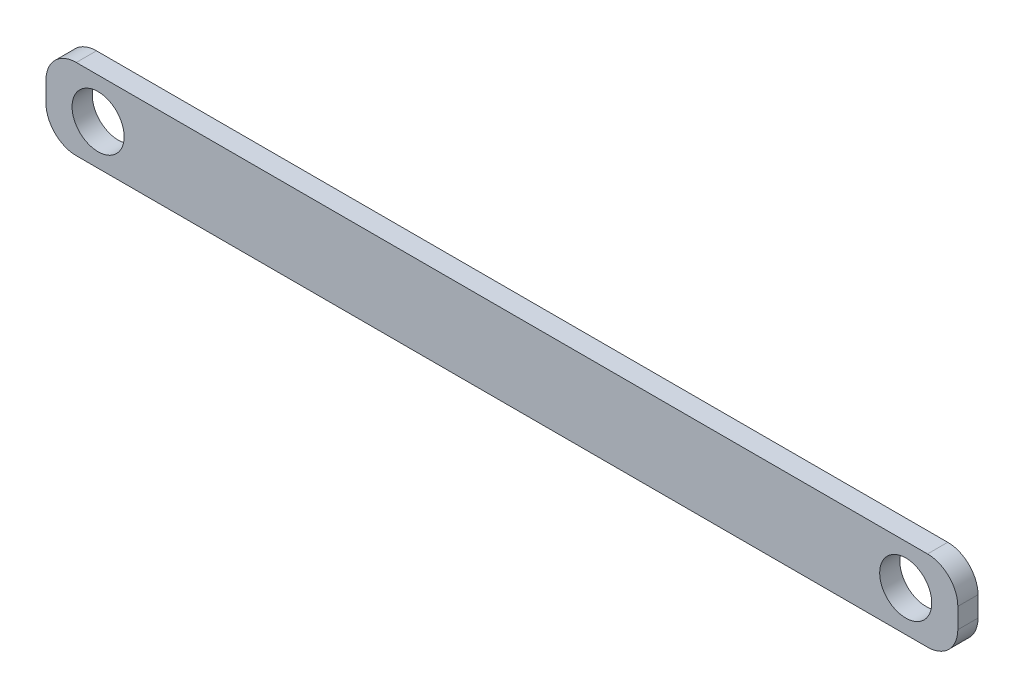
ISO-10303-21;
HEADER;
FILE_DESCRIPTION(('STEP AP214'),'2;1');
FILE_NAME('part.step','',(''),(''),'','','');
FILE_SCHEMA(('AUTOMOTIVE_DESIGN { 1 0 10303 214 1 1 1 1 }'));
ENDSEC;
DATA;
#1=APPLICATION_CONTEXT('core data for automotive mechanical design processes');
#2=APPLICATION_PROTOCOL_DEFINITION('international standard','automotive_design',2000,#1);
#3=PRODUCT_CONTEXT('',#1,'mechanical');
#4=PRODUCT('Part','Part','',(#3));
#5=PRODUCT_RELATED_PRODUCT_CATEGORY('part','',(#4));
#6=PRODUCT_DEFINITION_FORMATION('','',#4);
#7=PRODUCT_DEFINITION_CONTEXT('part definition',#1,'design');
#8=PRODUCT_DEFINITION('design','',#6,#7);
#9=PRODUCT_DEFINITION_SHAPE('','',#8);
#10=(LENGTH_UNIT() NAMED_UNIT(*) SI_UNIT(.MILLI.,.METRE.));
#11=(NAMED_UNIT(*) PLANE_ANGLE_UNIT() SI_UNIT($,.RADIAN.));
#12=(NAMED_UNIT(*) SI_UNIT($,.STERADIAN.) SOLID_ANGLE_UNIT());
#13=UNCERTAINTY_MEASURE_WITH_UNIT(LENGTH_MEASURE(1.E-05),#10,'distance_accuracy_value','');
#14=(GEOMETRIC_REPRESENTATION_CONTEXT(3) GLOBAL_UNCERTAINTY_ASSIGNED_CONTEXT((#13)) GLOBAL_UNIT_ASSIGNED_CONTEXT((#10,
#11,#12)) REPRESENTATION_CONTEXT('',''));
#15=CARTESIAN_POINT('',(0.,0.,0.));
#16=DIRECTION('',(0.,0.,1.));
#17=DIRECTION('',(1.,0.,0.));
#18=AXIS2_PLACEMENT_3D('',#15,#16,#17);
#19=CARTESIAN_POINT('',(0.,0.,5.));
#20=DIRECTION('',(0.,0.,-1.));
#21=DIRECTION('',(-1.,0.,0.));
#22=AXIS2_PLACEMENT_3D('',#19,#20,#21);
#23=PLANE('',#22);
#24=CARTESIAN_POINT('',(-100.,0.,5.));
#25=DIRECTION('',(0.,0.,1.));
#26=DIRECTION('',(1.,0.,0.));
#27=AXIS2_PLACEMENT_3D('',#24,#25,#26);
#28=CIRCLE('',#27,6.45000000000002);
#29=CARTESIAN_POINT('',(-93.55,0.,5.));
#30=VERTEX_POINT('',#29);
#31=EDGE_CURVE('E134',#30,#30,#28,.T.);
#32=ORIENTED_EDGE('',*,*,#31,.F.);
#33=EDGE_LOOP('',(#32));
#34=FACE_BOUND('',#33,.T.);
#35=DIRECTION('',(0.,-1.,0.));
#36=VECTOR('',#35,1.);
#37=CARTESIAN_POINT('',(-112.9,-10.,5.));
#38=LINE('',#37,#36);
#39=CARTESIAN_POINT('',(-112.9,2.49999999999999,5.));
#40=VERTEX_POINT('',#39);
#41=CARTESIAN_POINT('',(-112.9,-2.50000000000002,5.));
#42=VERTEX_POINT('',#41);
#43=EDGE_CURVE('E139',#40,#42,#38,.T.);
#44=ORIENTED_EDGE('',*,*,#43,.T.);
#45=CARTESIAN_POINT('',(-105.4,-2.50000000000002,5.));
#46=DIRECTION('',(0.,0.,-1.));
#47=DIRECTION('',(-1.,0.,0.));
#48=AXIS2_PLACEMENT_3D('',#45,#46,#47);
#49=CIRCLE('',#48,7.5);
#50=CARTESIAN_POINT('',(-105.4,-10.,5.));
#51=VERTEX_POINT('',#50);
#52=EDGE_CURVE('E153',#42,#51,#49,.F.);
#53=ORIENTED_EDGE('',*,*,#52,.T.);
#54=DIRECTION('',(1.,0.,0.));
#55=VECTOR('',#54,1.);
#56=CARTESIAN_POINT('',(-112.9,-10.,5.));
#57=LINE('',#56,#55);
#58=CARTESIAN_POINT('',(105.4,-9.99999999999999,5.));
#59=VERTEX_POINT('',#58);
#60=EDGE_CURVE('E120',#51,#59,#57,.T.);
#61=ORIENTED_EDGE('',*,*,#60,.T.);
#62=CARTESIAN_POINT('',(105.4,-2.49999999999999,5.));
#63=DIRECTION('',(0.,0.,-1.));
#64=DIRECTION('',(-1.,0.,0.));
#65=AXIS2_PLACEMENT_3D('',#62,#63,#64);
#66=CIRCLE('',#65,7.5);
#67=CARTESIAN_POINT('',(112.9,-2.49999999999999,5.));
#68=VERTEX_POINT('',#67);
#69=EDGE_CURVE('E149',#59,#68,#66,.F.);
#70=ORIENTED_EDGE('',*,*,#69,.T.);
#71=DIRECTION('',(0.,1.,0.));
#72=VECTOR('',#71,1.);
#73=CARTESIAN_POINT('',(112.9,-9.99999999999999,5.));
#74=LINE('',#73,#72);
#75=CARTESIAN_POINT('',(112.9,2.50000000000001,5.));
#76=VERTEX_POINT('',#75);
#77=EDGE_CURVE('E162',#68,#76,#74,.T.);
#78=ORIENTED_EDGE('',*,*,#77,.T.);
#79=CARTESIAN_POINT('',(105.4,2.50000000000001,5.));
#80=DIRECTION('',(0.,0.,-1.));
#81=DIRECTION('',(-1.,0.,0.));
#82=AXIS2_PLACEMENT_3D('',#79,#80,#81);
#83=CIRCLE('',#82,7.5);
#84=CARTESIAN_POINT('',(105.4,10.,5.));
#85=VERTEX_POINT('',#84);
#86=EDGE_CURVE('E55',#76,#85,#83,.F.);
#87=ORIENTED_EDGE('',*,*,#86,.T.);
#88=DIRECTION('',(-1.,0.,0.));
#89=VECTOR('',#88,1.);
#90=CARTESIAN_POINT('',(-112.9,9.99999999999999,5.));
#91=LINE('',#90,#89);
#92=CARTESIAN_POINT('',(-105.4,9.99999999999999,5.));
#93=VERTEX_POINT('',#92);
#94=EDGE_CURVE('E140',#85,#93,#91,.T.);
#95=ORIENTED_EDGE('',*,*,#94,.T.);
#96=CARTESIAN_POINT('',(-105.4,2.49999999999999,5.));
#97=DIRECTION('',(0.,0.,-1.));
#98=DIRECTION('',(-1.,0.,0.));
#99=AXIS2_PLACEMENT_3D('',#96,#97,#98);
#100=CIRCLE('',#99,7.5);
#101=EDGE_CURVE('E151',#93,#40,#100,.F.);
#102=ORIENTED_EDGE('',*,*,#101,.T.);
#103=EDGE_LOOP('',(#44,#53,#61,#70,#78,#87,#95,#102));
#104=FACE_BOUND('',#103,.T.);
#105=CARTESIAN_POINT('',(100.,0.,5.));
#106=DIRECTION('',(0.,0.,1.));
#107=DIRECTION('',(-1.,0.,0.));
#108=AXIS2_PLACEMENT_3D('',#105,#106,#107);
#109=CIRCLE('',#108,6.45000000000002);
#110=CARTESIAN_POINT('',(93.55,0.,5.));
#111=VERTEX_POINT('',#110);
#112=EDGE_CURVE('E185',#111,#111,#109,.T.);
#113=ORIENTED_EDGE('',*,*,#112,.F.);
#114=EDGE_LOOP('',(#113));
#115=FACE_BOUND('',#114,.T.);
#116=ADVANCED_FACE('F33',(#34,#104,#115),#23,.F.);
#117=CARTESIAN_POINT('',(0.,0.,0.));
#118=DIRECTION('',(0.,0.,-1.));
#119=DIRECTION('',(-1.,0.,0.));
#120=AXIS2_PLACEMENT_3D('',#117,#118,#119);
#121=PLANE('',#120);
#122=CARTESIAN_POINT('',(-100.,0.,0.));
#123=DIRECTION('',(0.,0.,1.));
#124=DIRECTION('',(1.,0.,0.));
#125=AXIS2_PLACEMENT_3D('',#122,#123,#124);
#126=CIRCLE('',#125,6.45000000000002);
#127=CARTESIAN_POINT('',(-93.55,0.,0.));
#128=VERTEX_POINT('',#127);
#129=EDGE_CURVE('E182',#128,#128,#126,.T.);
#130=ORIENTED_EDGE('',*,*,#129,.T.);
#131=EDGE_LOOP('',(#130));
#132=FACE_BOUND('',#131,.T.);
#133=DIRECTION('',(1.,0.,0.));
#134=VECTOR('',#133,1.);
#135=CARTESIAN_POINT('',(-112.9,-10.,0.));
#136=LINE('',#135,#134);
#137=CARTESIAN_POINT('',(-105.4,-10.,0.));
#138=VERTEX_POINT('',#137);
#139=CARTESIAN_POINT('',(105.4,-9.99999999999999,0.));
#140=VERTEX_POINT('',#139);
#141=EDGE_CURVE('E117',#138,#140,#136,.T.);
#142=ORIENTED_EDGE('',*,*,#141,.F.);
#143=CARTESIAN_POINT('',(-105.4,-2.50000000000002,0.));
#144=DIRECTION('',(0.,0.,-1.));
#145=DIRECTION('',(-1.,0.,0.));
#146=AXIS2_PLACEMENT_3D('',#143,#144,#145);
#147=CIRCLE('',#146,7.5);
#148=CARTESIAN_POINT('',(-112.9,-2.50000000000002,0.));
#149=VERTEX_POINT('',#148);
#150=EDGE_CURVE('E100',#138,#149,#147,.T.);
#151=ORIENTED_EDGE('',*,*,#150,.T.);
#152=DIRECTION('',(0.,-1.,0.));
#153=VECTOR('',#152,1.);
#154=CARTESIAN_POINT('',(-112.9,-10.,0.));
#155=LINE('',#154,#153);
#156=CARTESIAN_POINT('',(-112.9,2.49999999999999,0.));
#157=VERTEX_POINT('',#156);
#158=EDGE_CURVE('E129',#157,#149,#155,.T.);
#159=ORIENTED_EDGE('',*,*,#158,.F.);
#160=CARTESIAN_POINT('',(-105.4,2.49999999999999,0.));
#161=DIRECTION('',(0.,0.,-1.));
#162=DIRECTION('',(-1.,0.,0.));
#163=AXIS2_PLACEMENT_3D('',#160,#161,#162);
#164=CIRCLE('',#163,7.5);
#165=CARTESIAN_POINT('',(-105.4,9.99999999999999,0.));
#166=VERTEX_POINT('',#165);
#167=EDGE_CURVE('E111',#157,#166,#164,.T.);
#168=ORIENTED_EDGE('',*,*,#167,.T.);
#169=DIRECTION('',(-1.,0.,0.));
#170=VECTOR('',#169,1.);
#171=CARTESIAN_POINT('',(-112.9,9.99999999999999,0.));
#172=LINE('',#171,#170);
#173=CARTESIAN_POINT('',(105.4,10.,0.));
#174=VERTEX_POINT('',#173);
#175=EDGE_CURVE('E132',#174,#166,#172,.T.);
#176=ORIENTED_EDGE('',*,*,#175,.F.);
#177=CARTESIAN_POINT('',(105.4,2.50000000000001,0.));
#178=DIRECTION('',(0.,0.,-1.));
#179=DIRECTION('',(-1.,0.,0.));
#180=AXIS2_PLACEMENT_3D('',#177,#178,#179);
#181=CIRCLE('',#180,7.5);
#182=CARTESIAN_POINT('',(112.9,2.50000000000001,0.));
#183=VERTEX_POINT('',#182);
#184=EDGE_CURVE('E121',#174,#183,#181,.T.);
#185=ORIENTED_EDGE('',*,*,#184,.T.);
#186=DIRECTION('',(0.,1.,0.));
#187=VECTOR('',#186,1.);
#188=CARTESIAN_POINT('',(112.9,-9.99999999999999,0.));
#189=LINE('',#188,#187);
#190=CARTESIAN_POINT('',(112.9,-2.49999999999999,0.));
#191=VERTEX_POINT('',#190);
#192=EDGE_CURVE('E128',#191,#183,#189,.T.);
#193=ORIENTED_EDGE('',*,*,#192,.F.);
#194=CARTESIAN_POINT('',(105.4,-2.49999999999999,0.));
#195=DIRECTION('',(0.,0.,-1.));
#196=DIRECTION('',(-1.,0.,0.));
#197=AXIS2_PLACEMENT_3D('',#194,#195,#196);
#198=CIRCLE('',#197,7.5);
#199=EDGE_CURVE('E127',#191,#140,#198,.T.);
#200=ORIENTED_EDGE('',*,*,#199,.T.);
#201=EDGE_LOOP('',(#142,#151,#159,#168,#176,#185,#193,#200));
#202=FACE_BOUND('',#201,.T.);
#203=CARTESIAN_POINT('',(100.,0.,0.));
#204=DIRECTION('',(0.,0.,1.));
#205=DIRECTION('',(-1.,0.,0.));
#206=AXIS2_PLACEMENT_3D('',#203,#204,#205);
#207=CIRCLE('',#206,6.45000000000002);
#208=CARTESIAN_POINT('',(93.55,0.,0.));
#209=VERTEX_POINT('',#208);
#210=EDGE_CURVE('E188',#209,#209,#207,.T.);
#211=ORIENTED_EDGE('',*,*,#210,.T.);
#212=EDGE_LOOP('',(#211));
#213=FACE_BOUND('',#212,.T.);
#214=ADVANCED_FACE('F124',(#132,#202,#213),#121,.T.);
#215=CARTESIAN_POINT('',(-112.9,-10.,5.));
#216=DIRECTION('',(1.,0.,0.));
#217=DIRECTION('',(0.,1.,0.));
#218=AXIS2_PLACEMENT_3D('',#215,#216,#217);
#219=PLANE('',#218);
#220=ORIENTED_EDGE('',*,*,#158,.T.);
#221=DIRECTION('',(0.,0.,-1.));
#222=VECTOR('',#221,1.);
#223=CARTESIAN_POINT('',(-112.9,-2.50000000000002,5.));
#224=LINE('',#223,#222);
#225=EDGE_CURVE('E105',#149,#42,#224,.F.);
#226=ORIENTED_EDGE('',*,*,#225,.T.);
#227=ORIENTED_EDGE('',*,*,#43,.F.);
#228=DIRECTION('',(0.,0.,-1.));
#229=VECTOR('',#228,1.);
#230=CARTESIAN_POINT('',(-112.9,2.49999999999999,5.));
#231=LINE('',#230,#229);
#232=EDGE_CURVE('E110',#40,#157,#231,.T.);
#233=ORIENTED_EDGE('',*,*,#232,.T.);
#234=EDGE_LOOP('',(#220,#226,#227,#233));
#235=FACE_BOUND('',#234,.T.);
#236=ADVANCED_FACE('F178',(#235),#219,.F.);
#237=CARTESIAN_POINT('',(-112.9,-10.,5.));
#238=DIRECTION('',(0.,1.,0.));
#239=DIRECTION('',(-1.,0.,0.));
#240=AXIS2_PLACEMENT_3D('',#237,#238,#239);
#241=PLANE('',#240);
#242=ORIENTED_EDGE('',*,*,#60,.F.);
#243=DIRECTION('',(0.,0.,-1.));
#244=VECTOR('',#243,1.);
#245=CARTESIAN_POINT('',(-105.4,-10.,5.));
#246=LINE('',#245,#244);
#247=EDGE_CURVE('E104',#51,#138,#246,.T.);
#248=ORIENTED_EDGE('',*,*,#247,.T.);
#249=ORIENTED_EDGE('',*,*,#141,.T.);
#250=DIRECTION('',(0.,0.,-1.));
#251=VECTOR('',#250,1.);
#252=CARTESIAN_POINT('',(105.4,-9.99999999999999,5.));
#253=LINE('',#252,#251);
#254=EDGE_CURVE('E122',#140,#59,#253,.F.);
#255=ORIENTED_EDGE('',*,*,#254,.T.);
#256=EDGE_LOOP('',(#242,#248,#249,#255));
#257=FACE_BOUND('',#256,.T.);
#258=ADVANCED_FACE('F116',(#257),#241,.F.);
#259=CARTESIAN_POINT('',(112.9,-9.99999999999999,5.));
#260=DIRECTION('',(-1.,0.,0.));
#261=DIRECTION('',(0.,0.,1.));
#262=AXIS2_PLACEMENT_3D('',#259,#260,#261);
#263=PLANE('',#262);
#264=ORIENTED_EDGE('',*,*,#77,.F.);
#265=DIRECTION('',(0.,0.,-1.));
#266=VECTOR('',#265,1.);
#267=CARTESIAN_POINT('',(112.9,-2.49999999999999,5.));
#268=LINE('',#267,#266);
#269=EDGE_CURVE('E11',#68,#191,#268,.T.);
#270=ORIENTED_EDGE('',*,*,#269,.T.);
#271=ORIENTED_EDGE('',*,*,#192,.T.);
#272=DIRECTION('',(0.,0.,-1.));
#273=VECTOR('',#272,1.);
#274=CARTESIAN_POINT('',(112.9,2.50000000000001,5.));
#275=LINE('',#274,#273);
#276=EDGE_CURVE('E41',#183,#76,#275,.F.);
#277=ORIENTED_EDGE('',*,*,#276,.T.);
#278=EDGE_LOOP('',(#264,#270,#271,#277));
#279=FACE_BOUND('',#278,.T.);
#280=ADVANCED_FACE('F161',(#279),#263,.F.);
#281=CARTESIAN_POINT('',(-112.9,9.99999999999999,5.));
#282=DIRECTION('',(0.,-1.,0.));
#283=DIRECTION('',(1.,0.,0.));
#284=AXIS2_PLACEMENT_3D('',#281,#282,#283);
#285=PLANE('',#284);
#286=ORIENTED_EDGE('',*,*,#175,.T.);
#287=DIRECTION('',(0.,0.,-1.));
#288=VECTOR('',#287,1.);
#289=CARTESIAN_POINT('',(-105.4,9.99999999999999,5.));
#290=LINE('',#289,#288);
#291=EDGE_CURVE('E48',#166,#93,#290,.F.);
#292=ORIENTED_EDGE('',*,*,#291,.T.);
#293=ORIENTED_EDGE('',*,*,#94,.F.);
#294=DIRECTION('',(0.,0.,-1.));
#295=VECTOR('',#294,1.);
#296=CARTESIAN_POINT('',(105.4,10.,5.));
#297=LINE('',#296,#295);
#298=EDGE_CURVE('E155',#85,#174,#297,.T.);
#299=ORIENTED_EDGE('',*,*,#298,.T.);
#300=EDGE_LOOP('',(#286,#292,#293,#299));
#301=FACE_BOUND('',#300,.T.);
#302=ADVANCED_FACE('F171',(#301),#285,.F.);
#303=CARTESIAN_POINT('',(-100.,0.,5.));
#304=DIRECTION('',(0.,0.,-1.));
#305=DIRECTION('',(-1.,0.,0.));
#306=AXIS2_PLACEMENT_3D('',#303,#304,#305);
#307=CYLINDRICAL_SURFACE('',#306,6.45000000000002);
#308=ORIENTED_EDGE('',*,*,#31,.T.);
#309=EDGE_LOOP('',(#308));
#310=FACE_BOUND('',#309,.T.);
#311=ORIENTED_EDGE('',*,*,#129,.F.);
#312=EDGE_LOOP('',(#311));
#313=FACE_BOUND('',#312,.T.);
#314=ADVANCED_FACE('F206',(#310,#313),#307,.F.);
#315=CARTESIAN_POINT('',(100.,0.,5.));
#316=DIRECTION('',(0.,0.,-1.));
#317=DIRECTION('',(-1.,0.,0.));
#318=AXIS2_PLACEMENT_3D('',#315,#316,#317);
#319=CYLINDRICAL_SURFACE('',#318,6.45000000000002);
#320=ORIENTED_EDGE('',*,*,#112,.T.);
#321=EDGE_LOOP('',(#320));
#322=FACE_BOUND('',#321,.T.);
#323=ORIENTED_EDGE('',*,*,#210,.F.);
#324=EDGE_LOOP('',(#323));
#325=FACE_BOUND('',#324,.T.);
#326=ADVANCED_FACE('F194',(#322,#325),#319,.F.);
#327=CARTESIAN_POINT('',(-105.4,-2.50000000000002,5.));
#328=DIRECTION('',(0.,0.,-1.));
#329=DIRECTION('',(-1.,0.,0.));
#330=AXIS2_PLACEMENT_3D('',#327,#328,#329);
#331=CYLINDRICAL_SURFACE('',#330,7.5);
#332=ORIENTED_EDGE('',*,*,#52,.F.);
#333=ORIENTED_EDGE('',*,*,#225,.F.);
#334=ORIENTED_EDGE('',*,*,#150,.F.);
#335=ORIENTED_EDGE('',*,*,#247,.F.);
#336=EDGE_LOOP('',(#332,#333,#334,#335));
#337=FACE_BOUND('',#336,.T.);
#338=ADVANCED_FACE('F103',(#337),#331,.T.);
#339=CARTESIAN_POINT('',(-105.4,2.49999999999999,5.));
#340=DIRECTION('',(0.,0.,-1.));
#341=DIRECTION('',(-1.,0.,0.));
#342=AXIS2_PLACEMENT_3D('',#339,#340,#341);
#343=CYLINDRICAL_SURFACE('',#342,7.5);
#344=ORIENTED_EDGE('',*,*,#101,.F.);
#345=ORIENTED_EDGE('',*,*,#291,.F.);
#346=ORIENTED_EDGE('',*,*,#167,.F.);
#347=ORIENTED_EDGE('',*,*,#232,.F.);
#348=EDGE_LOOP('',(#344,#345,#346,#347));
#349=FACE_BOUND('',#348,.T.);
#350=ADVANCED_FACE('F175',(#349),#343,.T.);
#351=CARTESIAN_POINT('',(105.4,-2.49999999999999,5.));
#352=DIRECTION('',(0.,0.,-1.));
#353=DIRECTION('',(-1.,0.,0.));
#354=AXIS2_PLACEMENT_3D('',#351,#352,#353);
#355=CYLINDRICAL_SURFACE('',#354,7.5);
#356=ORIENTED_EDGE('',*,*,#69,.F.);
#357=ORIENTED_EDGE('',*,*,#254,.F.);
#358=ORIENTED_EDGE('',*,*,#199,.F.);
#359=ORIENTED_EDGE('',*,*,#269,.F.);
#360=EDGE_LOOP('',(#356,#357,#358,#359));
#361=FACE_BOUND('',#360,.T.);
#362=ADVANCED_FACE('F220',(#361),#355,.T.);
#363=CARTESIAN_POINT('',(105.4,2.50000000000001,5.));
#364=DIRECTION('',(0.,0.,-1.));
#365=DIRECTION('',(-1.,0.,0.));
#366=AXIS2_PLACEMENT_3D('',#363,#364,#365);
#367=CYLINDRICAL_SURFACE('',#366,7.5);
#368=ORIENTED_EDGE('',*,*,#86,.F.);
#369=ORIENTED_EDGE('',*,*,#276,.F.);
#370=ORIENTED_EDGE('',*,*,#184,.F.);
#371=ORIENTED_EDGE('',*,*,#298,.F.);
#372=EDGE_LOOP('',(#368,#369,#370,#371));
#373=FACE_BOUND('',#372,.T.);
#374=ADVANCED_FACE('F35',(#373),#367,.T.);
#375=CLOSED_SHELL('',(#116,#214,#236,#258,#280,#302,#314,#326,#338,#350,#362,#374));
#376=MANIFOLD_SOLID_BREP('B2',#375);
#377=ADVANCED_BREP_SHAPE_REPRESENTATION('',(#18,#376),#14);
#378=SHAPE_DEFINITION_REPRESENTATION(#9,#377);
ENDSEC;
END-ISO-10303-21;
